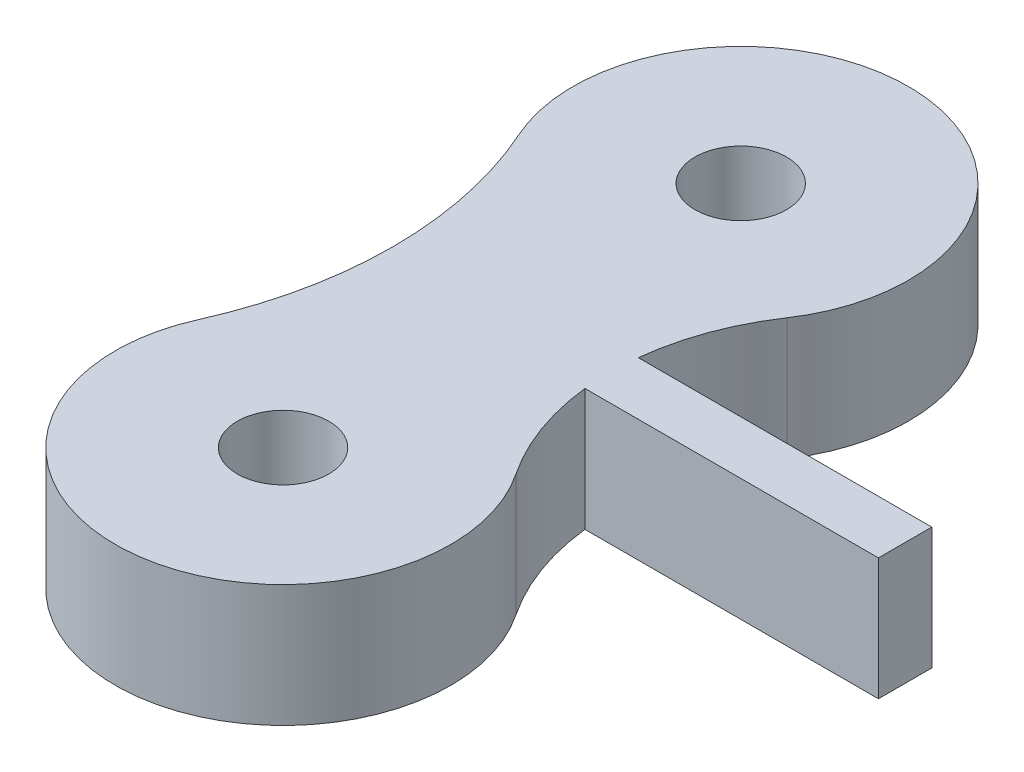
ISO-10303-21;
HEADER;
FILE_DESCRIPTION(('STEP AP214'),'2;1');
FILE_NAME('part.step','',(''),(''),'','','');
FILE_SCHEMA(('AUTOMOTIVE_DESIGN { 1 0 10303 214 1 1 1 1 }'));
ENDSEC;
DATA;
#1=APPLICATION_CONTEXT('core data for automotive mechanical design processes');
#2=APPLICATION_PROTOCOL_DEFINITION('international standard','automotive_design',2000,#1);
#3=PRODUCT_CONTEXT('',#1,'mechanical');
#4=PRODUCT('Part','Part','',(#3));
#5=PRODUCT_RELATED_PRODUCT_CATEGORY('part','',(#4));
#6=PRODUCT_DEFINITION_FORMATION('','',#4);
#7=PRODUCT_DEFINITION_CONTEXT('part definition',#1,'design');
#8=PRODUCT_DEFINITION('design','',#6,#7);
#9=PRODUCT_DEFINITION_SHAPE('','',#8);
#10=(LENGTH_UNIT() NAMED_UNIT(*) SI_UNIT(.MILLI.,.METRE.));
#11=(NAMED_UNIT(*) PLANE_ANGLE_UNIT() SI_UNIT($,.RADIAN.));
#12=(NAMED_UNIT(*) SI_UNIT($,.STERADIAN.) SOLID_ANGLE_UNIT());
#13=UNCERTAINTY_MEASURE_WITH_UNIT(LENGTH_MEASURE(1.E-05),#10,'distance_accuracy_value','');
#14=(GEOMETRIC_REPRESENTATION_CONTEXT(3) GLOBAL_UNCERTAINTY_ASSIGNED_CONTEXT((#13)) GLOBAL_UNIT_ASSIGNED_CONTEXT((#10,
#11,#12)) REPRESENTATION_CONTEXT('',''));
#15=CARTESIAN_POINT('',(0.,0.,0.));
#16=DIRECTION('',(0.,0.,1.));
#17=DIRECTION('',(1.,0.,0.));
#18=AXIS2_PLACEMENT_3D('',#15,#16,#17);
#19=CARTESIAN_POINT('',(11.2011417498977,4.,7.5));
#20=DIRECTION('',(0.,1.,0.));
#21=DIRECTION('',(0.,0.,1.));
#22=AXIS2_PLACEMENT_3D('',#19,#20,#21);
#23=PLANE('',#22);
#24=CARTESIAN_POINT('',(0.,4.,0.));
#25=DIRECTION('',(0.,1.,0.));
#26=DIRECTION('',(0.,0.,1.));
#27=AXIS2_PLACEMENT_3D('',#24,#25,#26);
#28=CIRCLE('',#27,1.5);
#29=CARTESIAN_POINT('',(0.,4.,1.5));
#30=VERTEX_POINT('',#29);
#31=EDGE_CURVE('E134',#30,#30,#28,.T.);
#32=ORIENTED_EDGE('',*,*,#31,.F.);
#33=EDGE_LOOP('',(#32));
#34=FACE_BOUND('',#33,.T.);
#35=DIRECTION('',(1.,0.,0.));
#36=VECTOR('',#35,1.);
#37=CARTESIAN_POINT('',(12.886719117386,4.,8.37435581292679));
#38=LINE('',#37,#36);
#39=CARTESIAN_POINT('',(3.26899409905488,4.,8.37435581292679));
#40=VERTEX_POINT('',#39);
#41=CARTESIAN_POINT('',(12.886719117386,4.,8.37435581292679));
#42=VERTEX_POINT('',#41);
#43=EDGE_CURVE('E145',#40,#42,#38,.T.);
#44=ORIENTED_EDGE('',*,*,#43,.T.);
#45=DIRECTION('',(0.,0.,-1.));
#46=VECTOR('',#45,1.);
#47=CARTESIAN_POINT('',(12.886719117386,4.,6.62564418707321));
#48=LINE('',#47,#46);
#49=CARTESIAN_POINT('',(12.886719117386,4.,6.62564418707321));
#50=VERTEX_POINT('',#49);
#51=EDGE_CURVE('E93',#42,#50,#48,.T.);
#52=ORIENTED_EDGE('',*,*,#51,.T.);
#53=DIRECTION('',(-1.,0.,0.));
#54=VECTOR('',#53,1.);
#55=CARTESIAN_POINT('',(3.26899409905488,4.,6.62564418707321));
#56=LINE('',#55,#54);
#57=CARTESIAN_POINT('',(3.26899409905488,4.,6.62564418707321));
#58=VERTEX_POINT('',#57);
#59=EDGE_CURVE('E160',#50,#58,#56,.T.);
#60=ORIENTED_EDGE('',*,*,#59,.T.);
#61=CARTESIAN_POINT('',(11.2011417498977,4.,7.5));
#62=DIRECTION('',(0.,-1.,0.));
#63=DIRECTION('',(0.,0.,1.));
#64=AXIS2_PLACEMENT_3D('',#61,#62,#63);
#65=CIRCLE('',#64,7.98019200535737);
#66=CARTESIAN_POINT('',(4.57013368948702,4.,3.06004543433848));
#67=VERTEX_POINT('',#66);
#68=EDGE_CURVE('E173',#58,#67,#65,.T.);
#69=ORIENTED_EDGE('',*,*,#68,.T.);
#70=CARTESIAN_POINT('',(0.,4.,0.));
#71=DIRECTION('',(0.,1.,0.));
#72=DIRECTION('',(0.,0.,1.));
#73=AXIS2_PLACEMENT_3D('',#70,#71,#72);
#74=CIRCLE('',#73,5.5);
#75=CARTESIAN_POINT('',(-5.02114667405746,4.,2.24456812719099));
#76=VERTEX_POINT('',#75);
#77=EDGE_CURVE('E112',#67,#76,#74,.T.);
#78=ORIENTED_EDGE('',*,*,#77,.T.);
#79=CARTESIAN_POINT('',(-16.7776596304784,4.,7.5));
#80=DIRECTION('',(0.,-1.,0.));
#81=DIRECTION('',(0.,0.,-1.));
#82=AXIS2_PLACEMENT_3D('',#79,#80,#81);
#83=CIRCLE('',#82,12.8777001465413);
#84=CARTESIAN_POINT('',(-5.02114667405746,4.,12.755431872809));
#85=VERTEX_POINT('',#84);
#86=EDGE_CURVE('E106',#76,#85,#83,.T.);
#87=ORIENTED_EDGE('',*,*,#86,.T.);
#88=CARTESIAN_POINT('',(0.,4.,15.));
#89=DIRECTION('',(0.,1.,0.));
#90=DIRECTION('',(0.,0.,1.));
#91=AXIS2_PLACEMENT_3D('',#88,#89,#90);
#92=CIRCLE('',#91,5.5);
#93=CARTESIAN_POINT('',(4.57013368948701,4.,11.9399545656615));
#94=VERTEX_POINT('',#93);
#95=EDGE_CURVE('E110',#85,#94,#92,.T.);
#96=ORIENTED_EDGE('',*,*,#95,.T.);
#97=CARTESIAN_POINT('',(11.2011417498977,4.,7.5));
#98=DIRECTION('',(0.,-1.,0.));
#99=DIRECTION('',(0.,0.,1.));
#100=AXIS2_PLACEMENT_3D('',#97,#98,#99);
#101=CIRCLE('',#100,7.98019200535737);
#102=EDGE_CURVE('E50',#94,#40,#101,.T.);
#103=ORIENTED_EDGE('',*,*,#102,.T.);
#104=EDGE_LOOP('',(#44,#52,#60,#69,#78,#87,#96,#103));
#105=FACE_BOUND('',#104,.T.);
#106=CARTESIAN_POINT('',(0.,4.,15.));
#107=DIRECTION('',(0.,1.,0.));
#108=DIRECTION('',(0.,0.,1.));
#109=AXIS2_PLACEMENT_3D('',#106,#107,#108);
#110=CIRCLE('',#109,1.5);
#111=CARTESIAN_POINT('',(0.,4.,16.5));
#112=VERTEX_POINT('',#111);
#113=EDGE_CURVE('E182',#112,#112,#110,.T.);
#114=ORIENTED_EDGE('',*,*,#113,.F.);
#115=EDGE_LOOP('',(#114));
#116=FACE_BOUND('',#115,.T.);
#117=ADVANCED_FACE('F33',(#34,#105,#116),#23,.T.);
#118=CARTESIAN_POINT('',(11.2011417498977,0.,7.5));
#119=DIRECTION('',(0.,1.,0.));
#120=DIRECTION('',(0.,0.,1.));
#121=AXIS2_PLACEMENT_3D('',#118,#119,#120);
#122=PLANE('',#121);
#123=DIRECTION('',(1.,0.,0.));
#124=VECTOR('',#123,1.);
#125=CARTESIAN_POINT('',(12.886719117386,0.,8.37435581292679));
#126=LINE('',#125,#124);
#127=CARTESIAN_POINT('',(3.26899409905488,0.,8.37435581292679));
#128=VERTEX_POINT('',#127);
#129=CARTESIAN_POINT('',(12.886719117386,0.,8.37435581292679));
#130=VERTEX_POINT('',#129);
#131=EDGE_CURVE('E130',#128,#130,#126,.T.);
#132=ORIENTED_EDGE('',*,*,#131,.F.);
#133=CARTESIAN_POINT('',(11.2011417498977,0.,7.5));
#134=DIRECTION('',(0.,-1.,0.));
#135=DIRECTION('',(0.,0.,1.));
#136=AXIS2_PLACEMENT_3D('',#133,#134,#135);
#137=CIRCLE('',#136,7.98019200535737);
#138=CARTESIAN_POINT('',(4.57013368948701,0.,11.9399545656615));
#139=VERTEX_POINT('',#138);
#140=EDGE_CURVE('E85',#139,#128,#137,.T.);
#141=ORIENTED_EDGE('',*,*,#140,.F.);
#142=CARTESIAN_POINT('',(0.,0.,15.));
#143=DIRECTION('',(0.,1.,0.));
#144=DIRECTION('',(0.,0.,1.));
#145=AXIS2_PLACEMENT_3D('',#142,#143,#144);
#146=CIRCLE('',#145,5.5);
#147=CARTESIAN_POINT('',(-5.02114667405746,0.,12.755431872809));
#148=VERTEX_POINT('',#147);
#149=EDGE_CURVE('E79',#148,#139,#146,.T.);
#150=ORIENTED_EDGE('',*,*,#149,.F.);
#151=CARTESIAN_POINT('',(-16.7776596304784,0.,7.5));
#152=DIRECTION('',(0.,-1.,0.));
#153=DIRECTION('',(0.,0.,-1.));
#154=AXIS2_PLACEMENT_3D('',#151,#152,#153);
#155=CIRCLE('',#154,12.8777001465413);
#156=CARTESIAN_POINT('',(-5.02114667405746,0.,2.24456812719099));
#157=VERTEX_POINT('',#156);
#158=EDGE_CURVE('E120',#157,#148,#155,.T.);
#159=ORIENTED_EDGE('',*,*,#158,.F.);
#160=CARTESIAN_POINT('',(0.,0.,0.));
#161=DIRECTION('',(0.,1.,0.));
#162=DIRECTION('',(0.,0.,1.));
#163=AXIS2_PLACEMENT_3D('',#160,#161,#162);
#164=CIRCLE('',#163,5.5);
#165=CARTESIAN_POINT('',(4.57013368948702,0.,3.06004543433848));
#166=VERTEX_POINT('',#165);
#167=EDGE_CURVE('E140',#166,#157,#164,.T.);
#168=ORIENTED_EDGE('',*,*,#167,.F.);
#169=CARTESIAN_POINT('',(11.2011417498977,0.,7.5));
#170=DIRECTION('',(0.,-1.,0.));
#171=DIRECTION('',(0.,0.,1.));
#172=AXIS2_PLACEMENT_3D('',#169,#170,#171);
#173=CIRCLE('',#172,7.98019200535737);
#174=CARTESIAN_POINT('',(3.26899409905488,0.,6.62564418707321));
#175=VERTEX_POINT('',#174);
#176=EDGE_CURVE('E138',#175,#166,#173,.T.);
#177=ORIENTED_EDGE('',*,*,#176,.F.);
#178=DIRECTION('',(-1.,0.,0.));
#179=VECTOR('',#178,1.);
#180=CARTESIAN_POINT('',(3.26899409905488,0.,6.62564418707321));
#181=LINE('',#180,#179);
#182=CARTESIAN_POINT('',(12.886719117386,0.,6.62564418707321));
#183=VERTEX_POINT('',#182);
#184=EDGE_CURVE('E136',#183,#175,#181,.T.);
#185=ORIENTED_EDGE('',*,*,#184,.F.);
#186=DIRECTION('',(0.,0.,-1.));
#187=VECTOR('',#186,1.);
#188=CARTESIAN_POINT('',(12.886719117386,0.,6.62564418707321));
#189=LINE('',#188,#187);
#190=EDGE_CURVE('E133',#130,#183,#189,.T.);
#191=ORIENTED_EDGE('',*,*,#190,.F.);
#192=EDGE_LOOP('',(#132,#141,#150,#159,#168,#177,#185,#191));
#193=FACE_BOUND('',#192,.T.);
#194=CARTESIAN_POINT('',(0.,0.,0.));
#195=DIRECTION('',(0.,1.,0.));
#196=DIRECTION('',(0.,0.,1.));
#197=AXIS2_PLACEMENT_3D('',#194,#195,#196);
#198=CIRCLE('',#197,1.5);
#199=CARTESIAN_POINT('',(0.,0.,1.5));
#200=VERTEX_POINT('',#199);
#201=EDGE_CURVE('E179',#200,#200,#198,.T.);
#202=ORIENTED_EDGE('',*,*,#201,.T.);
#203=EDGE_LOOP('',(#202));
#204=FACE_BOUND('',#203,.T.);
#205=CARTESIAN_POINT('',(0.,0.,15.));
#206=DIRECTION('',(0.,1.,0.));
#207=DIRECTION('',(0.,0.,1.));
#208=AXIS2_PLACEMENT_3D('',#205,#206,#207);
#209=CIRCLE('',#208,1.5);
#210=CARTESIAN_POINT('',(0.,0.,16.5));
#211=VERTEX_POINT('',#210);
#212=EDGE_CURVE('E185',#211,#211,#209,.T.);
#213=ORIENTED_EDGE('',*,*,#212,.T.);
#214=EDGE_LOOP('',(#213));
#215=FACE_BOUND('',#214,.T.);
#216=ADVANCED_FACE('F164',(#193,#204,#215),#122,.F.);
#217=CARTESIAN_POINT('',(12.886719117386,4.,8.37435581292679));
#218=DIRECTION('',(0.,0.,-1.));
#219=DIRECTION('',(-1.,0.,0.));
#220=AXIS2_PLACEMENT_3D('',#217,#218,#219);
#221=PLANE('',#220);
#222=ORIENTED_EDGE('',*,*,#131,.T.);
#223=DIRECTION('',(0.,-1.,0.));
#224=VECTOR('',#223,1.);
#225=CARTESIAN_POINT('',(12.886719117386,4.,8.37435581292679));
#226=LINE('',#225,#224);
#227=EDGE_CURVE('E11',#42,#130,#226,.T.);
#228=ORIENTED_EDGE('',*,*,#227,.F.);
#229=ORIENTED_EDGE('',*,*,#43,.F.);
#230=DIRECTION('',(0.,-1.,0.));
#231=VECTOR('',#230,1.);
#232=CARTESIAN_POINT('',(3.26899409905488,4.,8.37435581292679));
#233=LINE('',#232,#231);
#234=EDGE_CURVE('E126',#40,#128,#233,.T.);
#235=ORIENTED_EDGE('',*,*,#234,.T.);
#236=EDGE_LOOP('',(#222,#228,#229,#235));
#237=FACE_BOUND('',#236,.T.);
#238=ADVANCED_FACE('F35',(#237),#221,.F.);
#239=CARTESIAN_POINT('',(12.886719117386,4.,6.62564418707321));
#240=DIRECTION('',(-1.,0.,0.));
#241=DIRECTION('',(0.,0.,1.));
#242=AXIS2_PLACEMENT_3D('',#239,#240,#241);
#243=PLANE('',#242);
#244=ORIENTED_EDGE('',*,*,#190,.T.);
#245=DIRECTION('',(0.,-1.,0.));
#246=VECTOR('',#245,1.);
#247=CARTESIAN_POINT('',(12.886719117386,4.,6.62564418707321));
#248=LINE('',#247,#246);
#249=EDGE_CURVE('E42',#50,#183,#248,.T.);
#250=ORIENTED_EDGE('',*,*,#249,.F.);
#251=ORIENTED_EDGE('',*,*,#51,.F.);
#252=ORIENTED_EDGE('',*,*,#227,.T.);
#253=EDGE_LOOP('',(#244,#250,#251,#252));
#254=FACE_BOUND('',#253,.T.);
#255=ADVANCED_FACE('F217',(#254),#243,.F.);
#256=CARTESIAN_POINT('',(3.26899409905488,4.,6.62564418707321));
#257=DIRECTION('',(0.,0.,1.));
#258=DIRECTION('',(1.,0.,0.));
#259=AXIS2_PLACEMENT_3D('',#256,#257,#258);
#260=PLANE('',#259);
#261=ORIENTED_EDGE('',*,*,#184,.T.);
#262=DIRECTION('',(0.,-1.,0.));
#263=VECTOR('',#262,1.);
#264=CARTESIAN_POINT('',(3.26899409905488,4.,6.62564418707321));
#265=LINE('',#264,#263);
#266=EDGE_CURVE('E152',#58,#175,#265,.T.);
#267=ORIENTED_EDGE('',*,*,#266,.F.);
#268=ORIENTED_EDGE('',*,*,#59,.F.);
#269=ORIENTED_EDGE('',*,*,#249,.T.);
#270=EDGE_LOOP('',(#261,#267,#268,#269));
#271=FACE_BOUND('',#270,.T.);
#272=ADVANCED_FACE('F158',(#271),#260,.F.);
#273=CARTESIAN_POINT('',(11.2011417498977,4.,7.5));
#274=DIRECTION('',(0.,-1.,0.));
#275=DIRECTION('',(0.,0.,-1.));
#276=AXIS2_PLACEMENT_3D('',#273,#274,#275);
#277=CYLINDRICAL_SURFACE('',#276,7.98019200535737);
#278=ORIENTED_EDGE('',*,*,#176,.T.);
#279=DIRECTION('',(0.,-1.,0.));
#280=VECTOR('',#279,1.);
#281=CARTESIAN_POINT('',(4.57013368948702,4.,3.06004543433848));
#282=LINE('',#281,#280);
#283=EDGE_CURVE('E149',#67,#166,#282,.T.);
#284=ORIENTED_EDGE('',*,*,#283,.F.);
#285=ORIENTED_EDGE('',*,*,#68,.F.);
#286=ORIENTED_EDGE('',*,*,#266,.T.);
#287=EDGE_LOOP('',(#278,#284,#285,#286));
#288=FACE_BOUND('',#287,.T.);
#289=ADVANCED_FACE('F169',(#288),#277,.F.);
#290=CARTESIAN_POINT('',(0.,4.,0.));
#291=DIRECTION('',(0.,-1.,0.));
#292=DIRECTION('',(0.,0.,-1.));
#293=AXIS2_PLACEMENT_3D('',#290,#291,#292);
#294=CYLINDRICAL_SURFACE('',#293,5.5);
#295=ORIENTED_EDGE('',*,*,#167,.T.);
#296=DIRECTION('',(0.,-1.,0.));
#297=VECTOR('',#296,1.);
#298=CARTESIAN_POINT('',(-5.02114667405746,4.,2.24456812719099));
#299=LINE('',#298,#297);
#300=EDGE_CURVE('E121',#76,#157,#299,.T.);
#301=ORIENTED_EDGE('',*,*,#300,.F.);
#302=ORIENTED_EDGE('',*,*,#77,.F.);
#303=ORIENTED_EDGE('',*,*,#283,.T.);
#304=EDGE_LOOP('',(#295,#301,#302,#303));
#305=FACE_BOUND('',#304,.T.);
#306=ADVANCED_FACE('F172',(#305),#294,.T.);
#307=CARTESIAN_POINT('',(-16.7776596304784,4.,7.5));
#308=DIRECTION('',(0.,-1.,0.));
#309=DIRECTION('',(0.,0.,-1.));
#310=AXIS2_PLACEMENT_3D('',#307,#308,#309);
#311=CYLINDRICAL_SURFACE('',#310,12.8777001465413);
#312=ORIENTED_EDGE('',*,*,#158,.T.);
#313=DIRECTION('',(0.,-1.,0.));
#314=VECTOR('',#313,1.);
#315=CARTESIAN_POINT('',(-5.02114667405746,4.,12.755431872809));
#316=LINE('',#315,#314);
#317=EDGE_CURVE('E117',#85,#148,#316,.T.);
#318=ORIENTED_EDGE('',*,*,#317,.F.);
#319=ORIENTED_EDGE('',*,*,#86,.F.);
#320=ORIENTED_EDGE('',*,*,#300,.T.);
#321=EDGE_LOOP('',(#312,#318,#319,#320));
#322=FACE_BOUND('',#321,.T.);
#323=ADVANCED_FACE('F118',(#322),#311,.F.);
#324=CARTESIAN_POINT('',(0.,4.,15.));
#325=DIRECTION('',(0.,-1.,0.));
#326=DIRECTION('',(0.,0.,-1.));
#327=AXIS2_PLACEMENT_3D('',#324,#325,#326);
#328=CYLINDRICAL_SURFACE('',#327,5.5);
#329=ORIENTED_EDGE('',*,*,#149,.T.);
#330=DIRECTION('',(0.,-1.,0.));
#331=VECTOR('',#330,1.);
#332=CARTESIAN_POINT('',(4.57013368948701,4.,11.9399545656615));
#333=LINE('',#332,#331);
#334=EDGE_CURVE('E122',#94,#139,#333,.T.);
#335=ORIENTED_EDGE('',*,*,#334,.F.);
#336=ORIENTED_EDGE('',*,*,#95,.F.);
#337=ORIENTED_EDGE('',*,*,#317,.T.);
#338=EDGE_LOOP('',(#329,#335,#336,#337));
#339=FACE_BOUND('',#338,.T.);
#340=ADVANCED_FACE('F124',(#339),#328,.T.);
#341=CARTESIAN_POINT('',(11.2011417498977,4.,7.5));
#342=DIRECTION('',(0.,-1.,0.));
#343=DIRECTION('',(0.,0.,-1.));
#344=AXIS2_PLACEMENT_3D('',#341,#342,#343);
#345=CYLINDRICAL_SURFACE('',#344,7.98019200535737);
#346=ORIENTED_EDGE('',*,*,#140,.T.);
#347=ORIENTED_EDGE('',*,*,#234,.F.);
#348=ORIENTED_EDGE('',*,*,#102,.F.);
#349=ORIENTED_EDGE('',*,*,#334,.T.);
#350=EDGE_LOOP('',(#346,#347,#348,#349));
#351=FACE_BOUND('',#350,.T.);
#352=ADVANCED_FACE('F205',(#351),#345,.F.);
#353=CARTESIAN_POINT('',(0.,4.,0.));
#354=DIRECTION('',(0.,-1.,0.));
#355=DIRECTION('',(0.,0.,-1.));
#356=AXIS2_PLACEMENT_3D('',#353,#354,#355);
#357=CYLINDRICAL_SURFACE('',#356,1.5);
#358=ORIENTED_EDGE('',*,*,#31,.T.);
#359=EDGE_LOOP('',(#358));
#360=FACE_BOUND('',#359,.T.);
#361=ORIENTED_EDGE('',*,*,#201,.F.);
#362=EDGE_LOOP('',(#361));
#363=FACE_BOUND('',#362,.T.);
#364=ADVANCED_FACE('F202',(#360,#363),#357,.F.);
#365=CARTESIAN_POINT('',(0.,4.,15.));
#366=DIRECTION('',(0.,-1.,0.));
#367=DIRECTION('',(0.,0.,-1.));
#368=AXIS2_PLACEMENT_3D('',#365,#366,#367);
#369=CYLINDRICAL_SURFACE('',#368,1.5);
#370=ORIENTED_EDGE('',*,*,#113,.T.);
#371=EDGE_LOOP('',(#370));
#372=FACE_BOUND('',#371,.T.);
#373=ORIENTED_EDGE('',*,*,#212,.F.);
#374=EDGE_LOOP('',(#373));
#375=FACE_BOUND('',#374,.T.);
#376=ADVANCED_FACE('F191',(#372,#375),#369,.F.);
#377=CLOSED_SHELL('',(#117,#216,#238,#255,#272,#289,#306,#323,#340,#352,#364,#376));
#378=MANIFOLD_SOLID_BREP('B2',#377);
#379=ADVANCED_BREP_SHAPE_REPRESENTATION('',(#18,#378),#14);
#380=SHAPE_DEFINITION_REPRESENTATION(#9,#379);
ENDSEC;
END-ISO-10303-21;
